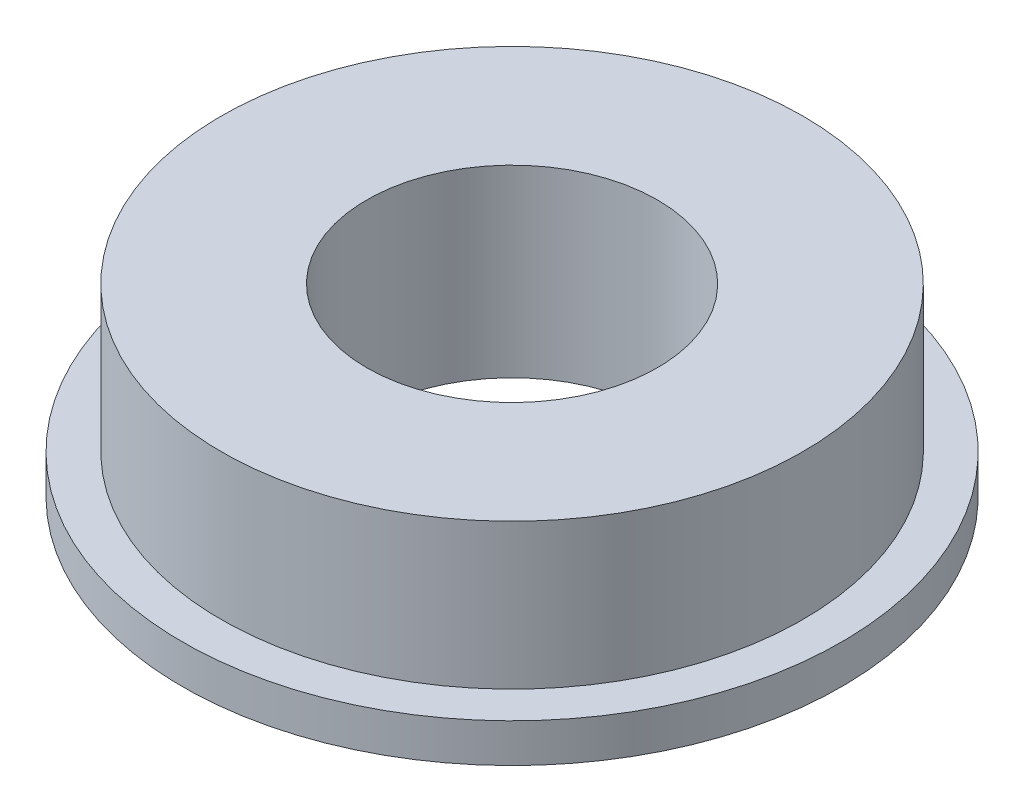
ISO-10303-21;
HEADER;
FILE_DESCRIPTION(('STEP AP214'),'2;1');
FILE_NAME('part.step','',(''),(''),'','','');
FILE_SCHEMA(('AUTOMOTIVE_DESIGN { 1 0 10303 214 1 1 1 1 }'));
ENDSEC;
DATA;
#1=APPLICATION_CONTEXT('core data for automotive mechanical design processes');
#2=APPLICATION_PROTOCOL_DEFINITION('international standard','automotive_design',2000,#1);
#3=PRODUCT_CONTEXT('',#1,'mechanical');
#4=PRODUCT('Part','Part','',(#3));
#5=PRODUCT_RELATED_PRODUCT_CATEGORY('part','',(#4));
#6=PRODUCT_DEFINITION_FORMATION('','',#4);
#7=PRODUCT_DEFINITION_CONTEXT('part definition',#1,'design');
#8=PRODUCT_DEFINITION('design','',#6,#7);
#9=PRODUCT_DEFINITION_SHAPE('','',#8);
#10=(LENGTH_UNIT() NAMED_UNIT(*) SI_UNIT(.MILLI.,.METRE.));
#11=(NAMED_UNIT(*) PLANE_ANGLE_UNIT() SI_UNIT($,.RADIAN.));
#12=(NAMED_UNIT(*) SI_UNIT($,.STERADIAN.) SOLID_ANGLE_UNIT());
#13=UNCERTAINTY_MEASURE_WITH_UNIT(LENGTH_MEASURE(1.E-05),#10,'distance_accuracy_value','');
#14=(GEOMETRIC_REPRESENTATION_CONTEXT(3) GLOBAL_UNCERTAINTY_ASSIGNED_CONTEXT((#13)) GLOBAL_UNIT_ASSIGNED_CONTEXT((#10,
#11,#12)) REPRESENTATION_CONTEXT('',''));
#15=CARTESIAN_POINT('',(0.,0.,0.));
#16=DIRECTION('',(0.,0.,1.));
#17=DIRECTION('',(1.,0.,0.));
#18=AXIS2_PLACEMENT_3D('',#15,#16,#17);
#19=CARTESIAN_POINT('',(0.,0.,0.));
#20=DIRECTION('',(0.,-1.,0.));
#21=DIRECTION('',(0.,0.,-1.));
#22=AXIS2_PLACEMENT_3D('',#19,#20,#21);
#23=CYLINDRICAL_SURFACE('',#22,3.);
#24=CARTESIAN_POINT('',(0.,0.,0.));
#25=DIRECTION('',(0.,-1.,0.));
#26=DIRECTION('',(0.,0.,-1.));
#27=AXIS2_PLACEMENT_3D('',#24,#25,#26);
#28=CIRCLE('',#27,3.);
#29=CARTESIAN_POINT('',(0.,0.,-3.));
#30=VERTEX_POINT('',#29);
#31=EDGE_CURVE('E56',#30,#30,#28,.T.);
#32=ORIENTED_EDGE('',*,*,#31,.T.);
#33=EDGE_LOOP('',(#32));
#34=FACE_BOUND('',#33,.T.);
#35=CARTESIAN_POINT('',(0.,3.8,0.));
#36=DIRECTION('',(0.,-1.,0.));
#37=DIRECTION('',(0.,0.,-1.));
#38=AXIS2_PLACEMENT_3D('',#35,#36,#37);
#39=CIRCLE('',#38,3.);
#40=CARTESIAN_POINT('',(0.,3.8,-3.));
#41=VERTEX_POINT('',#40);
#42=EDGE_CURVE('E10',#41,#41,#39,.T.);
#43=ORIENTED_EDGE('',*,*,#42,.F.);
#44=EDGE_LOOP('',(#43));
#45=FACE_BOUND('',#44,.T.);
#46=ADVANCED_FACE('F34',(#34,#45),#23,.F.);
#47=CARTESIAN_POINT('',(0.,3.8,0.));
#48=DIRECTION('',(0.,1.,0.));
#49=DIRECTION('',(0.,0.,1.));
#50=AXIS2_PLACEMENT_3D('',#47,#48,#49);
#51=PLANE('',#50);
#52=ORIENTED_EDGE('',*,*,#42,.T.);
#53=EDGE_LOOP('',(#52));
#54=FACE_BOUND('',#53,.T.);
#55=CARTESIAN_POINT('',(0.,3.8,0.));
#56=DIRECTION('',(0.,-1.,0.));
#57=DIRECTION('',(0.,0.,-1.));
#58=AXIS2_PLACEMENT_3D('',#55,#56,#57);
#59=CIRCLE('',#58,6.);
#60=CARTESIAN_POINT('',(0.,3.8,-6.));
#61=VERTEX_POINT('',#60);
#62=EDGE_CURVE('E40',#61,#61,#59,.T.);
#63=ORIENTED_EDGE('',*,*,#62,.F.);
#64=EDGE_LOOP('',(#63));
#65=FACE_BOUND('',#64,.T.);
#66=ADVANCED_FACE('F74',(#54,#65),#51,.T.);
#67=CARTESIAN_POINT('',(0.,0.,0.));
#68=DIRECTION('',(0.,-1.,0.));
#69=DIRECTION('',(0.,0.,-1.));
#70=AXIS2_PLACEMENT_3D('',#67,#68,#69);
#71=CYLINDRICAL_SURFACE('',#70,6.);
#72=ORIENTED_EDGE('',*,*,#62,.T.);
#73=EDGE_LOOP('',(#72));
#74=FACE_BOUND('',#73,.T.);
#75=CARTESIAN_POINT('',(0.,0.8,0.));
#76=DIRECTION('',(0.,-1.,0.));
#77=DIRECTION('',(0.,0.,-1.));
#78=AXIS2_PLACEMENT_3D('',#75,#76,#77);
#79=CIRCLE('',#78,6.);
#80=CARTESIAN_POINT('',(0.,0.8,-6.));
#81=VERTEX_POINT('',#80);
#82=EDGE_CURVE('E44',#81,#81,#79,.T.);
#83=ORIENTED_EDGE('',*,*,#82,.F.);
#84=EDGE_LOOP('',(#83));
#85=FACE_BOUND('',#84,.T.);
#86=ADVANCED_FACE('F78',(#74,#85),#71,.T.);
#87=CARTESIAN_POINT('',(0.,0.8,0.));
#88=DIRECTION('',(0.,1.,0.));
#89=DIRECTION('',(0.,0.,1.));
#90=AXIS2_PLACEMENT_3D('',#87,#88,#89);
#91=PLANE('',#90);
#92=ORIENTED_EDGE('',*,*,#82,.T.);
#93=EDGE_LOOP('',(#92));
#94=FACE_BOUND('',#93,.T.);
#95=CARTESIAN_POINT('',(0.,0.8,0.));
#96=DIRECTION('',(0.,-1.,0.));
#97=DIRECTION('',(0.,0.,-1.));
#98=AXIS2_PLACEMENT_3D('',#95,#96,#97);
#99=CIRCLE('',#98,6.8);
#100=CARTESIAN_POINT('',(0.,0.8,-6.8));
#101=VERTEX_POINT('',#100);
#102=EDGE_CURVE('E48',#101,#101,#99,.T.);
#103=ORIENTED_EDGE('',*,*,#102,.F.);
#104=EDGE_LOOP('',(#103));
#105=FACE_BOUND('',#104,.T.);
#106=ADVANCED_FACE('F70',(#94,#105),#91,.T.);
#107=CARTESIAN_POINT('',(0.,0.,0.));
#108=DIRECTION('',(0.,-1.,0.));
#109=DIRECTION('',(0.,0.,-1.));
#110=AXIS2_PLACEMENT_3D('',#107,#108,#109);
#111=CYLINDRICAL_SURFACE('',#110,6.8);
#112=ORIENTED_EDGE('',*,*,#102,.T.);
#113=EDGE_LOOP('',(#112));
#114=FACE_BOUND('',#113,.T.);
#115=CARTESIAN_POINT('',(0.,0.,0.));
#116=DIRECTION('',(0.,-1.,0.));
#117=DIRECTION('',(0.,0.,-1.));
#118=AXIS2_PLACEMENT_3D('',#115,#116,#117);
#119=CIRCLE('',#118,6.8);
#120=CARTESIAN_POINT('',(0.,0.,-6.8));
#121=VERTEX_POINT('',#120);
#122=EDGE_CURVE('E53',#121,#121,#119,.T.);
#123=ORIENTED_EDGE('',*,*,#122,.F.);
#124=EDGE_LOOP('',(#123));
#125=FACE_BOUND('',#124,.T.);
#126=ADVANCED_FACE('F64',(#114,#125),#111,.T.);
#127=CARTESIAN_POINT('',(0.,0.,0.));
#128=DIRECTION('',(0.,-1.,0.));
#129=DIRECTION('',(0.,0.,-1.));
#130=AXIS2_PLACEMENT_3D('',#127,#128,#129);
#131=PLANE('',#130);
#132=ORIENTED_EDGE('',*,*,#122,.T.);
#133=EDGE_LOOP('',(#132));
#134=FACE_BOUND('',#133,.T.);
#135=ORIENTED_EDGE('',*,*,#31,.F.);
#136=EDGE_LOOP('',(#135));
#137=FACE_BOUND('',#136,.T.);
#138=ADVANCED_FACE('F62',(#134,#137),#131,.T.);
#139=CLOSED_SHELL('',(#46,#66,#86,#106,#126,#138));
#140=MANIFOLD_SOLID_BREP('B2',#139);
#141=ADVANCED_BREP_SHAPE_REPRESENTATION('',(#18,#140),#14);
#142=SHAPE_DEFINITION_REPRESENTATION(#9,#141);
ENDSEC;
END-ISO-10303-21;
